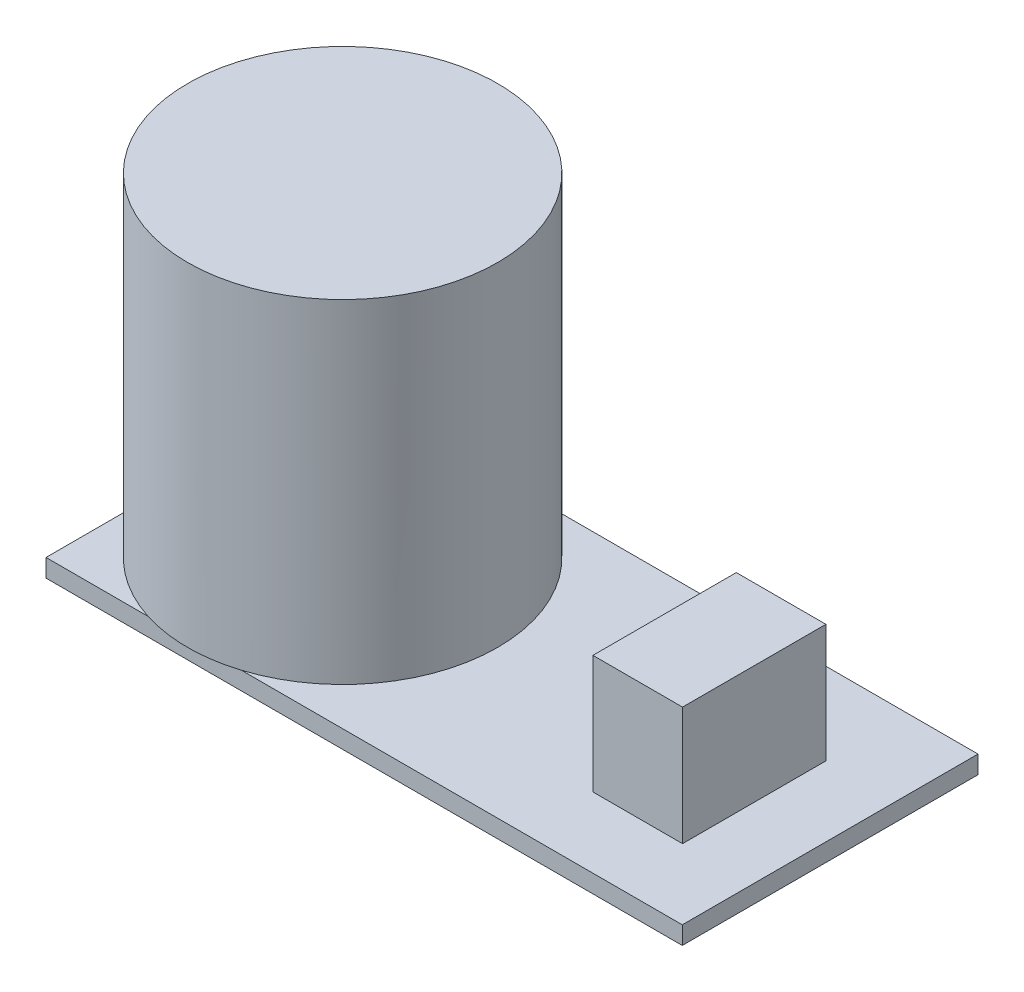
ISO-10303-21;
HEADER;
FILE_DESCRIPTION(('STEP AP214'),'2;1');
FILE_NAME('part.step','',(''),(''),'','','');
FILE_SCHEMA(('AUTOMOTIVE_DESIGN { 1 0 10303 214 1 1 1 1 }'));
ENDSEC;
DATA;
#1=APPLICATION_CONTEXT('core data for automotive mechanical design processes');
#2=APPLICATION_PROTOCOL_DEFINITION('international standard','automotive_design',2000,#1);
#3=PRODUCT_CONTEXT('',#1,'mechanical');
#4=PRODUCT('Part','Part','',(#3));
#5=PRODUCT_RELATED_PRODUCT_CATEGORY('part','',(#4));
#6=PRODUCT_DEFINITION_FORMATION('','',#4);
#7=PRODUCT_DEFINITION_CONTEXT('part definition',#1,'design');
#8=PRODUCT_DEFINITION('design','',#6,#7);
#9=PRODUCT_DEFINITION_SHAPE('','',#8);
#10=(LENGTH_UNIT() NAMED_UNIT(*) SI_UNIT(.MILLI.,.METRE.));
#11=(NAMED_UNIT(*) PLANE_ANGLE_UNIT() SI_UNIT($,.RADIAN.));
#12=(NAMED_UNIT(*) SI_UNIT($,.STERADIAN.) SOLID_ANGLE_UNIT());
#13=UNCERTAINTY_MEASURE_WITH_UNIT(LENGTH_MEASURE(1.E-05),#10,'distance_accuracy_value','');
#14=(GEOMETRIC_REPRESENTATION_CONTEXT(3) GLOBAL_UNCERTAINTY_ASSIGNED_CONTEXT((#13)) GLOBAL_UNIT_ASSIGNED_CONTEXT((#10,
#11,#12)) REPRESENTATION_CONTEXT('',''));
#15=CARTESIAN_POINT('',(0.,0.,0.));
#16=DIRECTION('',(0.,0.,1.));
#17=DIRECTION('',(1.,0.,0.));
#18=AXIS2_PLACEMENT_3D('',#15,#16,#17);
#19=CARTESIAN_POINT('',(-17.75,1.,8.25));
#20=DIRECTION('',(0.,1.,0.));
#21=DIRECTION('',(0.,0.,1.));
#22=AXIS2_PLACEMENT_3D('',#19,#20,#21);
#23=PLANE('',#22);
#24=CARTESIAN_POINT('',(-9.45,1.,0.));
#25=DIRECTION('',(0.,1.,0.));
#26=DIRECTION('',(0.,0.,1.));
#27=AXIS2_PLACEMENT_3D('',#24,#25,#26);
#28=CIRCLE('',#27,8.65);
#29=CARTESIAN_POINT('',(-6.84999999999999,1.,8.25));
#30=VERTEX_POINT('',#29);
#31=CARTESIAN_POINT('',(-6.84999999999999,1.,-8.25));
#32=VERTEX_POINT('',#31);
#33=EDGE_CURVE('E145',#30,#32,#28,.T.);
#34=ORIENTED_EDGE('',*,*,#33,.F.);
#35=DIRECTION('',(1.,0.,0.));
#36=VECTOR('',#35,1.);
#37=CARTESIAN_POINT('',(-17.75,1.,8.25));
#38=LINE('',#37,#36);
#39=CARTESIAN_POINT('',(17.75,1.,8.25));
#40=VERTEX_POINT('',#39);
#41=EDGE_CURVE('E156',#30,#40,#38,.T.);
#42=ORIENTED_EDGE('',*,*,#41,.T.);
#43=DIRECTION('',(0.,0.,-1.));
#44=VECTOR('',#43,1.);
#45=CARTESIAN_POINT('',(17.75,1.,-8.25));
#46=LINE('',#45,#44);
#47=CARTESIAN_POINT('',(17.75,1.,-8.25));
#48=VERTEX_POINT('',#47);
#49=EDGE_CURVE('E161',#40,#48,#46,.T.);
#50=ORIENTED_EDGE('',*,*,#49,.T.);
#51=DIRECTION('',(-1.,0.,0.));
#52=VECTOR('',#51,1.);
#53=CARTESIAN_POINT('',(-17.75,1.,-8.25));
#54=LINE('',#53,#52);
#55=EDGE_CURVE('E165',#48,#32,#54,.T.);
#56=ORIENTED_EDGE('',*,*,#55,.T.);
#57=EDGE_LOOP('',(#34,#42,#50,#56));
#58=FACE_BOUND('',#57,.T.);
#59=DIRECTION('',(-1.,0.,0.));
#60=VECTOR('',#59,1.);
#61=CARTESIAN_POINT('',(13.8377803184824,1.,-3.67629106667255));
#62=LINE('',#61,#60);
#63=CARTESIAN_POINT('',(13.8377803184824,1.,-3.67629106667255));
#64=VERTEX_POINT('',#63);
#65=CARTESIAN_POINT('',(8.83778031848237,1.,-3.67629106667255));
#66=VERTEX_POINT('',#65);
#67=EDGE_CURVE('E377',#64,#66,#62,.T.);
#68=ORIENTED_EDGE('',*,*,#67,.F.);
#69=DIRECTION('',(0.,0.,-1.));
#70=VECTOR('',#69,1.);
#71=CARTESIAN_POINT('',(13.8377803184824,1.,4.32370893332745));
#72=LINE('',#71,#70);
#73=CARTESIAN_POINT('',(13.8377803184824,1.,4.32370893332745));
#74=VERTEX_POINT('',#73);
#75=EDGE_CURVE('E139',#74,#64,#72,.T.);
#76=ORIENTED_EDGE('',*,*,#75,.F.);
#77=DIRECTION('',(1.,0.,0.));
#78=VECTOR('',#77,1.);
#79=CARTESIAN_POINT('',(13.8377803184824,1.,4.32370893332745));
#80=LINE('',#79,#78);
#81=CARTESIAN_POINT('',(8.83778031848237,1.,4.32370893332745));
#82=VERTEX_POINT('',#81);
#83=EDGE_CURVE('E135',#82,#74,#80,.T.);
#84=ORIENTED_EDGE('',*,*,#83,.F.);
#85=DIRECTION('',(0.,0.,1.));
#86=VECTOR('',#85,1.);
#87=CARTESIAN_POINT('',(8.83778031848237,1.,4.32370893332745));
#88=LINE('',#87,#86);
#89=EDGE_CURVE('E374',#66,#82,#88,.T.);
#90=ORIENTED_EDGE('',*,*,#89,.F.);
#91=EDGE_LOOP('',(#68,#76,#84,#90));
#92=FACE_BOUND('',#91,.T.);
#93=ADVANCED_FACE('F31',(#58,#92),#23,.T.);
#94=CARTESIAN_POINT('',(-12.05,1.,-8.25));
#95=VERTEX_POINT('',#94);
#96=CARTESIAN_POINT('',(-17.75,1.,-2.43567239176373));
#97=VERTEX_POINT('',#96);
#98=EDGE_CURVE('E11',#95,#97,#28,.T.);
#99=ORIENTED_EDGE('',*,*,#98,.F.);
#100=CARTESIAN_POINT('',(-17.75,1.,-8.25));
#101=VERTEX_POINT('',#100);
#102=EDGE_CURVE('E164',#95,#101,#54,.T.);
#103=ORIENTED_EDGE('',*,*,#102,.T.);
#104=DIRECTION('',(0.,0.,1.));
#105=VECTOR('',#104,1.);
#106=CARTESIAN_POINT('',(-17.75,1.,-8.25));
#107=LINE('',#106,#105);
#108=EDGE_CURVE('E154',#101,#97,#107,.T.);
#109=ORIENTED_EDGE('',*,*,#108,.T.);
#110=EDGE_LOOP('',(#99,#103,#109));
#111=FACE_BOUND('',#110,.T.);
#112=ADVANCED_FACE('F215',(#111),#23,.T.);
#113=CARTESIAN_POINT('',(-17.75,1.,-8.25));
#114=DIRECTION('',(1.,0.,0.));
#115=DIRECTION('',(0.,0.,-1.));
#116=AXIS2_PLACEMENT_3D('',#113,#114,#115);
#117=PLANE('',#116);
#118=DIRECTION('',(0.,0.,1.));
#119=VECTOR('',#118,1.);
#120=CARTESIAN_POINT('',(-17.75,0.,-8.25));
#121=LINE('',#120,#119);
#122=CARTESIAN_POINT('',(-17.75,0.,-8.25));
#123=VERTEX_POINT('',#122);
#124=CARTESIAN_POINT('',(-17.75,0.,8.25));
#125=VERTEX_POINT('',#124);
#126=EDGE_CURVE('E151',#123,#125,#121,.T.);
#127=ORIENTED_EDGE('',*,*,#126,.T.);
#128=DIRECTION('',(0.,-1.,0.));
#129=VECTOR('',#128,1.);
#130=CARTESIAN_POINT('',(-17.75,1.,8.25));
#131=LINE('',#130,#129);
#132=CARTESIAN_POINT('',(-17.75,1.,8.25));
#133=VERTEX_POINT('',#132);
#134=EDGE_CURVE('E35',#133,#125,#131,.T.);
#135=ORIENTED_EDGE('',*,*,#134,.F.);
#136=CARTESIAN_POINT('',(-17.75,1.,2.43567239176373));
#137=VERTEX_POINT('',#136);
#138=EDGE_CURVE('E158',#137,#133,#107,.T.);
#139=ORIENTED_EDGE('',*,*,#138,.F.);
#140=EDGE_CURVE('E157',#97,#137,#107,.T.);
#141=ORIENTED_EDGE('',*,*,#140,.F.);
#142=ORIENTED_EDGE('',*,*,#108,.F.);
#143=DIRECTION('',(0.,-1.,0.));
#144=VECTOR('',#143,1.);
#145=CARTESIAN_POINT('',(-17.75,1.,-8.25));
#146=LINE('',#145,#144);
#147=EDGE_CURVE('E168',#101,#123,#146,.T.);
#148=ORIENTED_EDGE('',*,*,#147,.T.);
#149=EDGE_LOOP('',(#127,#135,#139,#141,#142,#148));
#150=FACE_BOUND('',#149,.T.);
#151=ADVANCED_FACE('F33',(#150),#117,.F.);
#152=CARTESIAN_POINT('',(-17.75,1.,8.25));
#153=DIRECTION('',(0.,0.,-1.));
#154=DIRECTION('',(-1.,0.,0.));
#155=AXIS2_PLACEMENT_3D('',#152,#153,#154);
#156=PLANE('',#155);
#157=DIRECTION('',(1.,0.,0.));
#158=VECTOR('',#157,1.);
#159=CARTESIAN_POINT('',(-17.75,0.,8.25));
#160=LINE('',#159,#158);
#161=CARTESIAN_POINT('',(17.75,0.,8.25));
#162=VERTEX_POINT('',#161);
#163=EDGE_CURVE('E172',#125,#162,#160,.T.);
#164=ORIENTED_EDGE('',*,*,#163,.T.);
#165=DIRECTION('',(0.,-1.,0.));
#166=VECTOR('',#165,1.);
#167=CARTESIAN_POINT('',(17.75,1.,8.25));
#168=LINE('',#167,#166);
#169=EDGE_CURVE('E182',#40,#162,#168,.T.);
#170=ORIENTED_EDGE('',*,*,#169,.F.);
#171=ORIENTED_EDGE('',*,*,#41,.F.);
#172=CARTESIAN_POINT('',(-12.05,1.,8.25));
#173=VERTEX_POINT('',#172);
#174=EDGE_CURVE('E162',#173,#30,#38,.T.);
#175=ORIENTED_EDGE('',*,*,#174,.F.);
#176=EDGE_CURVE('E159',#133,#173,#38,.T.);
#177=ORIENTED_EDGE('',*,*,#176,.F.);
#178=ORIENTED_EDGE('',*,*,#134,.T.);
#179=EDGE_LOOP('',(#164,#170,#171,#175,#177,#178));
#180=FACE_BOUND('',#179,.T.);
#181=ADVANCED_FACE('F221',(#180),#156,.F.);
#182=CARTESIAN_POINT('',(17.75,1.,-8.25));
#183=DIRECTION('',(-1.,0.,0.));
#184=DIRECTION('',(0.,0.,1.));
#185=AXIS2_PLACEMENT_3D('',#182,#183,#184);
#186=PLANE('',#185);
#187=DIRECTION('',(0.,0.,-1.));
#188=VECTOR('',#187,1.);
#189=CARTESIAN_POINT('',(17.75,0.,-8.25));
#190=LINE('',#189,#188);
#191=CARTESIAN_POINT('',(17.75,0.,-8.25));
#192=VERTEX_POINT('',#191);
#193=EDGE_CURVE('E174',#162,#192,#190,.T.);
#194=ORIENTED_EDGE('',*,*,#193,.T.);
#195=DIRECTION('',(0.,-1.,0.));
#196=VECTOR('',#195,1.);
#197=CARTESIAN_POINT('',(17.75,1.,-8.25));
#198=LINE('',#197,#196);
#199=EDGE_CURVE('E180',#48,#192,#198,.T.);
#200=ORIENTED_EDGE('',*,*,#199,.F.);
#201=ORIENTED_EDGE('',*,*,#49,.F.);
#202=ORIENTED_EDGE('',*,*,#169,.T.);
#203=EDGE_LOOP('',(#194,#200,#201,#202));
#204=FACE_BOUND('',#203,.T.);
#205=ADVANCED_FACE('F225',(#204),#186,.F.);
#206=CARTESIAN_POINT('',(-17.75,1.,-8.25));
#207=DIRECTION('',(0.,0.,1.));
#208=DIRECTION('',(1.,0.,0.));
#209=AXIS2_PLACEMENT_3D('',#206,#207,#208);
#210=PLANE('',#209);
#211=DIRECTION('',(-1.,0.,0.));
#212=VECTOR('',#211,1.);
#213=CARTESIAN_POINT('',(-17.75,0.,-8.25));
#214=LINE('',#213,#212);
#215=EDGE_CURVE('E176',#192,#123,#214,.T.);
#216=ORIENTED_EDGE('',*,*,#215,.T.);
#217=ORIENTED_EDGE('',*,*,#147,.F.);
#218=ORIENTED_EDGE('',*,*,#102,.F.);
#219=EDGE_CURVE('E169',#32,#95,#54,.T.);
#220=ORIENTED_EDGE('',*,*,#219,.F.);
#221=ORIENTED_EDGE('',*,*,#55,.F.);
#222=ORIENTED_EDGE('',*,*,#199,.T.);
#223=EDGE_LOOP('',(#216,#217,#218,#220,#221,#222));
#224=FACE_BOUND('',#223,.T.);
#225=ADVANCED_FACE('F216',(#224),#210,.F.);
#226=EDGE_CURVE('E40',#137,#173,#28,.T.);
#227=ORIENTED_EDGE('',*,*,#226,.F.);
#228=ORIENTED_EDGE('',*,*,#138,.T.);
#229=ORIENTED_EDGE('',*,*,#176,.T.);
#230=EDGE_LOOP('',(#227,#228,#229));
#231=FACE_BOUND('',#230,.T.);
#232=ADVANCED_FACE('F200',(#231),#23,.T.);
#233=CARTESIAN_POINT('',(-17.75,0.,8.25));
#234=DIRECTION('',(0.,1.,0.));
#235=DIRECTION('',(0.,0.,1.));
#236=AXIS2_PLACEMENT_3D('',#233,#234,#235);
#237=PLANE('',#236);
#238=ORIENTED_EDGE('',*,*,#126,.F.);
#239=ORIENTED_EDGE('',*,*,#215,.F.);
#240=ORIENTED_EDGE('',*,*,#193,.F.);
#241=ORIENTED_EDGE('',*,*,#163,.F.);
#242=EDGE_LOOP('',(#238,#239,#240,#241));
#243=FACE_BOUND('',#242,.T.);
#244=ADVANCED_FACE('F220',(#243),#237,.F.);
#245=CARTESIAN_POINT('',(-9.45,1.,0.));
#246=DIRECTION('',(0.,1.,0.));
#247=DIRECTION('',(0.,0.,1.));
#248=AXIS2_PLACEMENT_3D('',#245,#246,#247);
#249=PLANE('',#248);
#250=EDGE_CURVE('E144',#97,#137,#28,.T.);
#251=ORIENTED_EDGE('',*,*,#250,.F.);
#252=ORIENTED_EDGE('',*,*,#140,.T.);
#253=EDGE_LOOP('',(#251,#252));
#254=FACE_BOUND('',#253,.T.);
#255=ADVANCED_FACE('F206',(#254),#249,.F.);
#256=EDGE_CURVE('E141',#173,#30,#28,.T.);
#257=ORIENTED_EDGE('',*,*,#256,.F.);
#258=ORIENTED_EDGE('',*,*,#174,.T.);
#259=EDGE_LOOP('',(#257,#258));
#260=FACE_BOUND('',#259,.T.);
#261=ADVANCED_FACE('F229',(#260),#249,.F.);
#262=EDGE_CURVE('E42',#32,#95,#28,.T.);
#263=ORIENTED_EDGE('',*,*,#262,.F.);
#264=ORIENTED_EDGE('',*,*,#219,.T.);
#265=EDGE_LOOP('',(#263,#264));
#266=FACE_BOUND('',#265,.T.);
#267=ADVANCED_FACE('F211',(#266),#249,.F.);
#268=CARTESIAN_POINT('',(-9.45,19.6,0.));
#269=DIRECTION('',(0.,-1.,0.));
#270=DIRECTION('',(0.,0.,-1.));
#271=AXIS2_PLACEMENT_3D('',#268,#269,#270);
#272=CYLINDRICAL_SURFACE('',#271,8.65);
#273=CARTESIAN_POINT('',(-9.45,19.6,0.));
#274=DIRECTION('',(0.,1.,0.));
#275=DIRECTION('',(0.,0.,1.));
#276=AXIS2_PLACEMENT_3D('',#273,#274,#275);
#277=CIRCLE('',#276,8.65);
#278=CARTESIAN_POINT('',(-9.45,19.6,8.65));
#279=VERTEX_POINT('',#278);
#280=EDGE_CURVE('E149',#279,#279,#277,.T.);
#281=ORIENTED_EDGE('',*,*,#280,.F.);
#282=EDGE_LOOP('',(#281));
#283=FACE_BOUND('',#282,.T.);
#284=ORIENTED_EDGE('',*,*,#33,.T.);
#285=ORIENTED_EDGE('',*,*,#262,.T.);
#286=ORIENTED_EDGE('',*,*,#98,.T.);
#287=ORIENTED_EDGE('',*,*,#250,.T.);
#288=ORIENTED_EDGE('',*,*,#226,.T.);
#289=ORIENTED_EDGE('',*,*,#256,.T.);
#290=EDGE_LOOP('',(#284,#285,#286,#287,#288,#289));
#291=FACE_BOUND('',#290,.T.);
#292=ADVANCED_FACE('F195',(#283,#291),#272,.T.);
#293=CARTESIAN_POINT('',(-9.45,19.6,0.));
#294=DIRECTION('',(0.,1.,0.));
#295=DIRECTION('',(0.,0.,1.));
#296=AXIS2_PLACEMENT_3D('',#293,#294,#295);
#297=PLANE('',#296);
#298=ORIENTED_EDGE('',*,*,#280,.T.);
#299=EDGE_LOOP('',(#298));
#300=FACE_BOUND('',#299,.T.);
#301=ADVANCED_FACE('F312',(#300),#297,.T.);
#302=CARTESIAN_POINT('',(13.8377803184824,7.6,4.32370893332745));
#303=DIRECTION('',(-1.,0.,0.));
#304=DIRECTION('',(0.,0.,1.));
#305=AXIS2_PLACEMENT_3D('',#302,#303,#304);
#306=PLANE('',#305);
#307=ORIENTED_EDGE('',*,*,#75,.T.);
#308=DIRECTION('',(0.,-1.,0.));
#309=VECTOR('',#308,1.);
#310=CARTESIAN_POINT('',(13.8377803184824,7.6,-3.67629106667255));
#311=LINE('',#310,#309);
#312=CARTESIAN_POINT('',(13.8377803184824,7.6,-3.67629106667255));
#313=VERTEX_POINT('',#312);
#314=EDGE_CURVE('E120',#313,#64,#311,.T.);
#315=ORIENTED_EDGE('',*,*,#314,.F.);
#316=DIRECTION('',(0.,0.,-1.));
#317=VECTOR('',#316,1.);
#318=CARTESIAN_POINT('',(13.8377803184824,7.6,4.32370893332745));
#319=LINE('',#318,#317);
#320=CARTESIAN_POINT('',(13.8377803184824,7.6,4.32370893332745));
#321=VERTEX_POINT('',#320);
#322=EDGE_CURVE('E127',#321,#313,#319,.T.);
#323=ORIENTED_EDGE('',*,*,#322,.F.);
#324=DIRECTION('',(0.,-1.,0.));
#325=VECTOR('',#324,1.);
#326=CARTESIAN_POINT('',(13.8377803184824,7.6,4.32370893332745));
#327=LINE('',#326,#325);
#328=EDGE_CURVE('E372',#321,#74,#327,.T.);
#329=ORIENTED_EDGE('',*,*,#328,.T.);
#330=EDGE_LOOP('',(#307,#315,#323,#329));
#331=FACE_BOUND('',#330,.T.);
#332=ADVANCED_FACE('F137',(#331),#306,.F.);
#333=CARTESIAN_POINT('',(13.8377803184824,7.6,-3.67629106667255));
#334=DIRECTION('',(0.,0.,1.));
#335=DIRECTION('',(1.,0.,0.));
#336=AXIS2_PLACEMENT_3D('',#333,#334,#335);
#337=PLANE('',#336);
#338=ORIENTED_EDGE('',*,*,#67,.T.);
#339=DIRECTION('',(0.,-1.,0.));
#340=VECTOR('',#339,1.);
#341=CARTESIAN_POINT('',(8.83778031848237,7.6,-3.67629106667255));
#342=LINE('',#341,#340);
#343=CARTESIAN_POINT('',(8.83778031848237,7.6,-3.67629106667255));
#344=VERTEX_POINT('',#343);
#345=EDGE_CURVE('E123',#344,#66,#342,.T.);
#346=ORIENTED_EDGE('',*,*,#345,.F.);
#347=DIRECTION('',(-1.,0.,0.));
#348=VECTOR('',#347,1.);
#349=CARTESIAN_POINT('',(13.8377803184824,7.6,-3.67629106667255));
#350=LINE('',#349,#348);
#351=EDGE_CURVE('E116',#313,#344,#350,.T.);
#352=ORIENTED_EDGE('',*,*,#351,.F.);
#353=ORIENTED_EDGE('',*,*,#314,.T.);
#354=EDGE_LOOP('',(#338,#346,#352,#353));
#355=FACE_BOUND('',#354,.T.);
#356=ADVANCED_FACE('F118',(#355),#337,.F.);
#357=CARTESIAN_POINT('',(8.83778031848237,7.6,4.32370893332745));
#358=DIRECTION('',(1.,0.,0.));
#359=DIRECTION('',(0.,0.,-1.));
#360=AXIS2_PLACEMENT_3D('',#357,#358,#359);
#361=PLANE('',#360);
#362=ORIENTED_EDGE('',*,*,#89,.T.);
#363=DIRECTION('',(0.,-1.,0.));
#364=VECTOR('',#363,1.);
#365=CARTESIAN_POINT('',(8.83778031848237,7.6,4.32370893332745));
#366=LINE('',#365,#364);
#367=CARTESIAN_POINT('',(8.83778031848237,7.6,4.32370893332745));
#368=VERTEX_POINT('',#367);
#369=EDGE_CURVE('E49',#368,#82,#366,.T.);
#370=ORIENTED_EDGE('',*,*,#369,.F.);
#371=DIRECTION('',(0.,0.,1.));
#372=VECTOR('',#371,1.);
#373=CARTESIAN_POINT('',(8.83778031848237,7.6,4.32370893332745));
#374=LINE('',#373,#372);
#375=EDGE_CURVE('E126',#344,#368,#374,.T.);
#376=ORIENTED_EDGE('',*,*,#375,.F.);
#377=ORIENTED_EDGE('',*,*,#345,.T.);
#378=EDGE_LOOP('',(#362,#370,#376,#377));
#379=FACE_BOUND('',#378,.T.);
#380=ADVANCED_FACE('F341',(#379),#361,.F.);
#381=CARTESIAN_POINT('',(13.8377803184824,7.6,4.32370893332745));
#382=DIRECTION('',(0.,0.,-1.));
#383=DIRECTION('',(-1.,0.,0.));
#384=AXIS2_PLACEMENT_3D('',#381,#382,#383);
#385=PLANE('',#384);
#386=ORIENTED_EDGE('',*,*,#83,.T.);
#387=ORIENTED_EDGE('',*,*,#328,.F.);
#388=DIRECTION('',(1.,0.,0.));
#389=VECTOR('',#388,1.);
#390=CARTESIAN_POINT('',(13.8377803184824,7.6,4.32370893332745));
#391=LINE('',#390,#389);
#392=EDGE_CURVE('E131',#368,#321,#391,.T.);
#393=ORIENTED_EDGE('',*,*,#392,.F.);
#394=ORIENTED_EDGE('',*,*,#369,.T.);
#395=EDGE_LOOP('',(#386,#387,#393,#394));
#396=FACE_BOUND('',#395,.T.);
#397=ADVANCED_FACE('F350',(#396),#385,.F.);
#398=CARTESIAN_POINT('',(13.8377803184824,7.6,-3.67629106667255));
#399=DIRECTION('',(0.,1.,0.));
#400=DIRECTION('',(0.,0.,1.));
#401=AXIS2_PLACEMENT_3D('',#398,#399,#400);
#402=PLANE('',#401);
#403=ORIENTED_EDGE('',*,*,#322,.T.);
#404=ORIENTED_EDGE('',*,*,#351,.T.);
#405=ORIENTED_EDGE('',*,*,#375,.T.);
#406=ORIENTED_EDGE('',*,*,#392,.T.);
#407=EDGE_LOOP('',(#403,#404,#405,#406));
#408=FACE_BOUND('',#407,.T.);
#409=ADVANCED_FACE('F130',(#408),#402,.T.);
#410=CLOSED_SHELL('',(#93,#112,#151,#181,#205,#225,#232,#244,#255,#261,#267,#292,#301,#332,#356,
#380,#397,#409));
#411=MANIFOLD_SOLID_BREP('B2',#410);
#412=ADVANCED_BREP_SHAPE_REPRESENTATION('',(#18,#411),#14);
#413=SHAPE_DEFINITION_REPRESENTATION(#9,#412);
ENDSEC;
END-ISO-10303-21;
